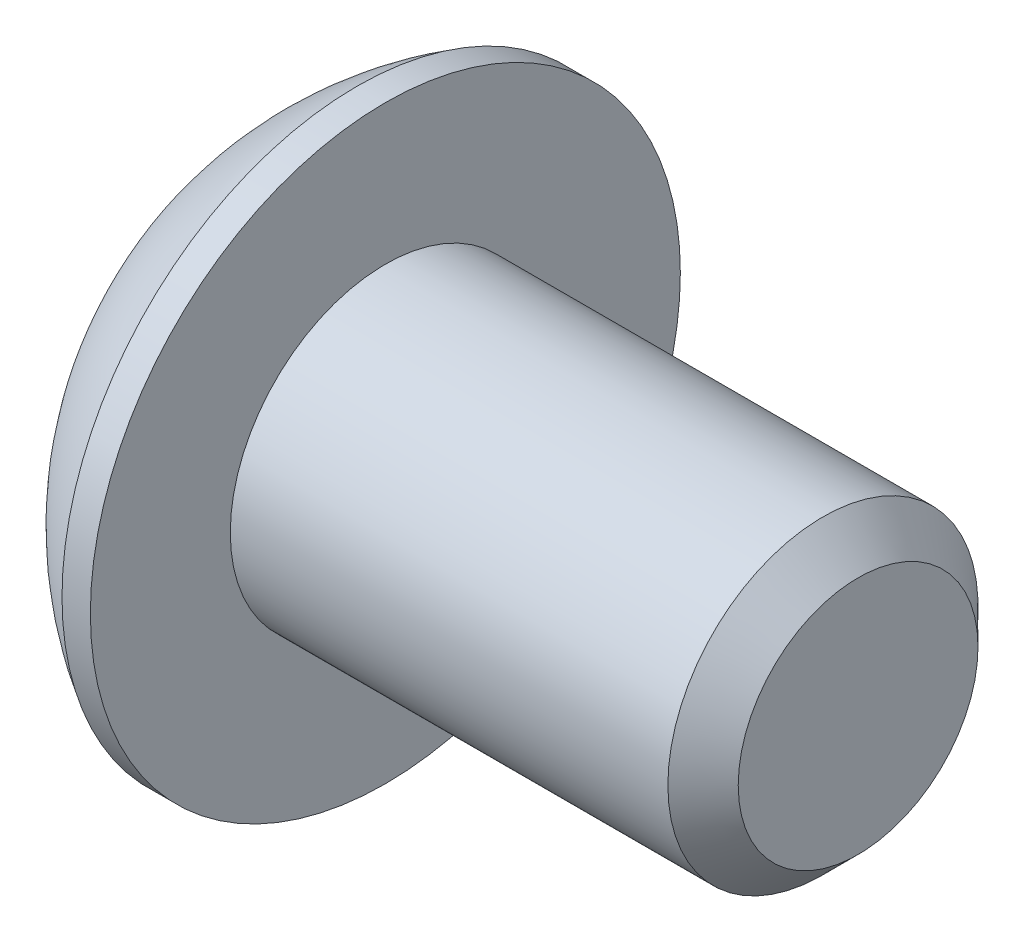
ISO-10303-21;
HEADER;
FILE_DESCRIPTION(('STEP AP214'),'2;1');
FILE_NAME('part.step','',(''),(''),'','','');
FILE_SCHEMA(('AUTOMOTIVE_DESIGN { 1 0 10303 214 1 1 1 1 }'));
ENDSEC;
DATA;
#1=APPLICATION_CONTEXT('core data for automotive mechanical design processes');
#2=APPLICATION_PROTOCOL_DEFINITION('international standard','automotive_design',2000,#1);
#3=PRODUCT_CONTEXT('',#1,'mechanical');
#4=PRODUCT('Part','Part','',(#3));
#5=PRODUCT_RELATED_PRODUCT_CATEGORY('part','',(#4));
#6=PRODUCT_DEFINITION_FORMATION('','',#4);
#7=PRODUCT_DEFINITION_CONTEXT('part definition',#1,'design');
#8=PRODUCT_DEFINITION('design','',#6,#7);
#9=PRODUCT_DEFINITION_SHAPE('','',#8);
#10=(LENGTH_UNIT() NAMED_UNIT(*) SI_UNIT(.MILLI.,.METRE.));
#11=(NAMED_UNIT(*) PLANE_ANGLE_UNIT() SI_UNIT($,.RADIAN.));
#12=(NAMED_UNIT(*) SI_UNIT($,.STERADIAN.) SOLID_ANGLE_UNIT());
#13=UNCERTAINTY_MEASURE_WITH_UNIT(LENGTH_MEASURE(1.E-05),#10,'distance_accuracy_value','');
#14=(GEOMETRIC_REPRESENTATION_CONTEXT(3) GLOBAL_UNCERTAINTY_ASSIGNED_CONTEXT((#13)) GLOBAL_UNIT_ASSIGNED_CONTEXT((#10,
#11,#12)) REPRESENTATION_CONTEXT('',''));
#15=CARTESIAN_POINT('',(0.,0.,0.));
#16=DIRECTION('',(0.,0.,1.));
#17=DIRECTION('',(1.,0.,0.));
#18=AXIS2_PLACEMENT_3D('',#15,#16,#17);
#19=CARTESIAN_POINT('',(8.55980000000001,0.,0.));
#20=DIRECTION('',(-1.,0.,0.));
#21=DIRECTION('',(0.,0.,1.));
#22=AXIS2_PLACEMENT_3D('',#19,#20,#21);
#23=PLANE('',#22);
#24=CARTESIAN_POINT('',(8.55979999994361,0.,0.));
#25=DIRECTION('',(-1.,0.,0.));
#26=DIRECTION('',(0.,0.,1.));
#27=AXIS2_PLACEMENT_3D('',#24,#25,#26);
#28=CIRCLE('',#27,1.61036000008604);
#29=CARTESIAN_POINT('',(8.55979999994361,0.,1.61036000008608));
#30=VERTEX_POINT('',#29);
#31=EDGE_CURVE('E20',#30,#30,#28,.T.);
#32=ORIENTED_EDGE('',*,*,#31,.F.);
#33=EDGE_LOOP('',(#32));
#34=FACE_BOUND('',#33,.T.);
#35=ADVANCED_FACE('F16',(#34),#23,.F.);
#36=CARTESIAN_POINT('',(8.08735999999044,0.,0.));
#37=DIRECTION('',(-1.,0.,0.));
#38=DIRECTION('',(0.,0.,1.));
#39=AXIS2_PLACEMENT_3D('',#36,#37,#38);
#40=CONICAL_SURFACE('',#39,2.08280000003921,0.785398163397448);
#41=ORIENTED_EDGE('',*,*,#31,.T.);
#42=EDGE_LOOP('',(#41));
#43=FACE_BOUND('',#42,.T.);
#44=CARTESIAN_POINT('',(8.08735999999999,0.,0.));
#45=DIRECTION('',(-1.,0.,0.));
#46=DIRECTION('',(0.,0.,1.));
#47=AXIS2_PLACEMENT_3D('',#44,#45,#46);
#48=CIRCLE('',#47,2.08280000000002);
#49=CARTESIAN_POINT('',(8.08735999999999,0.,2.08280000000002));
#50=VERTEX_POINT('',#49);
#51=EDGE_CURVE('E108',#50,#50,#48,.T.);
#52=ORIENTED_EDGE('',*,*,#51,.F.);
#53=EDGE_LOOP('',(#52));
#54=FACE_BOUND('',#53,.T.);
#55=ADVANCED_FACE('F310',(#43,#54),#40,.T.);
#56=CARTESIAN_POINT('',(1.32079999991674,0.,0.));
#57=DIRECTION('',(-1.,0.,0.));
#58=DIRECTION('',(0.,0.,1.));
#59=AXIS2_PLACEMENT_3D('',#56,#57,#58);
#60=CONICAL_SURFACE('',#59,1.19380000000998,1.04719755121067);
#61=CARTESIAN_POINT('',(2.01004075125866,0.,0.));
#62=VERTEX_POINT('',#61);
#63=VERTEX_LOOP('',#62);
#64=FACE_BOUND('',#63,.T.);
#65=CARTESIAN_POINT('',(1.32079999991674,0.,0.));
#66=DIRECTION('',(-1.,0.,0.));
#67=DIRECTION('',(0.,0.,1.));
#68=AXIS2_PLACEMENT_3D('',#65,#66,#67);
#69=CIRCLE('',#68,1.19380000000998);
#70=CARTESIAN_POINT('',(1.32079999995841,-1.03386112704217,0.596900000002525));
#71=VERTEX_POINT('',#70);
#72=CARTESIAN_POINT('',(1.32079999995191,0.,1.19379999997911));
#73=VERTEX_POINT('',#72);
#74=EDGE_CURVE('E93',#71,#73,#69,.T.);
#75=ORIENTED_EDGE('',*,*,#74,.T.);
#76=CARTESIAN_POINT('',(1.32079999991674,0.,0.));
#77=DIRECTION('',(-1.,0.,0.));
#78=DIRECTION('',(0.,0.,1.));
#79=AXIS2_PLACEMENT_3D('',#76,#77,#78);
#80=CIRCLE('',#79,1.19380000000998);
#81=CARTESIAN_POINT('',(1.32079999995841,1.03386112704219,0.596900000002536));
#82=VERTEX_POINT('',#81);
#83=EDGE_CURVE('E87',#73,#82,#80,.T.);
#84=ORIENTED_EDGE('',*,*,#83,.T.);
#85=CARTESIAN_POINT('',(1.32079999991674,0.,0.));
#86=DIRECTION('',(-1.,0.,0.));
#87=DIRECTION('',(0.,0.,1.));
#88=AXIS2_PLACEMENT_3D('',#85,#86,#87);
#89=CIRCLE('',#88,1.19380000000998);
#90=CARTESIAN_POINT('',(1.3207999999586,1.03386112704219,-0.596900000002484));
#91=VERTEX_POINT('',#90);
#92=EDGE_CURVE('E90',#82,#91,#89,.T.);
#93=ORIENTED_EDGE('',*,*,#92,.T.);
#94=CARTESIAN_POINT('',(1.32079999991674,0.,0.));
#95=DIRECTION('',(-1.,0.,0.));
#96=DIRECTION('',(0.,0.,1.));
#97=AXIS2_PLACEMENT_3D('',#94,#95,#96);
#98=CIRCLE('',#97,1.19380000000998);
#99=CARTESIAN_POINT('',(1.32079999995838,1.49000099134676E-12,-1.19380000000498));
#100=VERTEX_POINT('',#99);
#101=EDGE_CURVE('E152',#91,#100,#98,.T.);
#102=ORIENTED_EDGE('',*,*,#101,.T.);
#103=CARTESIAN_POINT('',(1.32079999991674,0.,0.));
#104=DIRECTION('',(-1.,0.,0.));
#105=DIRECTION('',(0.,0.,1.));
#106=AXIS2_PLACEMENT_3D('',#103,#104,#105);
#107=CIRCLE('',#106,1.19380000000998);
#108=CARTESIAN_POINT('',(1.3207999999586,-1.03386112704217,-0.596900000002466));
#109=VERTEX_POINT('',#108);
#110=EDGE_CURVE('E154',#100,#109,#107,.T.);
#111=ORIENTED_EDGE('',*,*,#110,.T.);
#112=CARTESIAN_POINT('',(1.32079999991674,0.,0.));
#113=DIRECTION('',(-1.,0.,0.));
#114=DIRECTION('',(0.,0.,1.));
#115=AXIS2_PLACEMENT_3D('',#112,#113,#114);
#116=CIRCLE('',#115,1.19380000000998);
#117=EDGE_CURVE('E156',#109,#71,#116,.T.);
#118=ORIENTED_EDGE('',*,*,#117,.T.);
#119=EDGE_LOOP('',(#75,#84,#93,#102,#111,#118));
#120=FACE_BOUND('',#119,.T.);
#121=ADVANCED_FACE('F89',(#64,#120),#60,.F.);
#122=CARTESIAN_POINT('',(0.,0.,0.));
#123=DIRECTION('',(-1.,0.,0.));
#124=DIRECTION('',(0.,0.,1.));
#125=AXIS2_PLACEMENT_3D('',#122,#123,#124);
#126=CYLINDRICAL_SURFACE('',#125,2.08280000000002);
#127=ORIENTED_EDGE('',*,*,#51,.T.);
#128=EDGE_LOOP('',(#127));
#129=FACE_BOUND('',#128,.T.);
#130=CARTESIAN_POINT('',(2.20979999999998,0.,0.));
#131=DIRECTION('',(-1.,0.,0.));
#132=DIRECTION('',(0.,0.,1.));
#133=AXIS2_PLACEMENT_3D('',#130,#131,#132);
#134=CIRCLE('',#133,2.08280000000002);
#135=CARTESIAN_POINT('',(2.20979999999998,0.,2.08280000000002));
#136=VERTEX_POINT('',#135);
#137=EDGE_CURVE('E149',#136,#136,#134,.F.);
#138=ORIENTED_EDGE('',*,*,#137,.T.);
#139=EDGE_LOOP('',(#138));
#140=FACE_BOUND('',#139,.T.);
#141=ADVANCED_FACE('F301',(#129,#140),#126,.T.);
#142=CARTESIAN_POINT('',(1.32080000000001,-2.06772225407572,-1.19379999999998));
#143=DIRECTION('',(1.,0.,0.));
#144=DIRECTION('',(0.,0.,-1.));
#145=AXIS2_PLACEMENT_3D('',#142,#143,#144);
#146=PLANE('',#145);
#147=DIRECTION('',(0.,-0.5,-0.866025403784439));
#148=VECTOR('',#147,1.);
#149=CARTESIAN_POINT('',(1.32080000000045,1.37848150271718,0.));
#150=LINE('',#149,#148);
#151=CARTESIAN_POINT('',(1.32080000000016,1.37848150271718,0.));
#152=VERTEX_POINT('',#151);
#153=EDGE_CURVE('E106',#91,#152,#150,.F.);
#154=ORIENTED_EDGE('',*,*,#153,.F.);
#155=ORIENTED_EDGE('',*,*,#92,.F.);
#156=DIRECTION('',(0.,0.5,-0.866025403784438));
#157=VECTOR('',#156,1.);
#158=CARTESIAN_POINT('',(1.32080000000001,0.68924075135858,1.19380000000002));
#159=LINE('',#158,#157);
#160=EDGE_CURVE('E104',#152,#82,#159,.F.);
#161=ORIENTED_EDGE('',*,*,#160,.F.);
#162=EDGE_LOOP('',(#154,#155,#161));
#163=FACE_BOUND('',#162,.T.);
#164=ADVANCED_FACE('F102',(#163),#146,.F.);
#165=CARTESIAN_POINT('',(1.32080000000001,-2.06772225407572,-1.19379999999998));
#166=DIRECTION('',(1.,0.,0.));
#167=DIRECTION('',(0.,0.,-1.));
#168=AXIS2_PLACEMENT_3D('',#165,#166,#167);
#169=PLANE('',#168);
#170=DIRECTION('',(0.,0.5,-0.866025403784438));
#171=VECTOR('',#170,1.);
#172=CARTESIAN_POINT('',(1.32080000000007,0.68924075135858,1.19380000000002));
#173=LINE('',#172,#171);
#174=CARTESIAN_POINT('',(1.32080000000028,0.6892407513586,1.19380000000003));
#175=VERTEX_POINT('',#174);
#176=EDGE_CURVE('E109',#82,#175,#173,.F.);
#177=ORIENTED_EDGE('',*,*,#176,.F.);
#178=ORIENTED_EDGE('',*,*,#83,.F.);
#179=DIRECTION('',(0.,1.,0.));
#180=VECTOR('',#179,1.);
#181=CARTESIAN_POINT('',(1.32080000000051,-0.689240751358577,1.19380000000003));
#182=LINE('',#181,#180);
#183=EDGE_CURVE('E112',#175,#73,#182,.F.);
#184=ORIENTED_EDGE('',*,*,#183,.F.);
#185=EDGE_LOOP('',(#177,#178,#184));
#186=FACE_BOUND('',#185,.T.);
#187=ADVANCED_FACE('F110',(#186),#169,.F.);
#188=CARTESIAN_POINT('',(1.32080000000001,-2.06772225407572,-1.19379999999998));
#189=DIRECTION('',(1.,0.,0.));
#190=DIRECTION('',(0.,0.,-1.));
#191=AXIS2_PLACEMENT_3D('',#188,#189,#190);
#192=PLANE('',#191);
#193=DIRECTION('',(0.,1.,0.));
#194=VECTOR('',#193,1.);
#195=CARTESIAN_POINT('',(1.32080000000057,-0.689240751358577,1.19380000000003));
#196=LINE('',#195,#194);
#197=CARTESIAN_POINT('',(1.32080000000045,-0.689240751358574,1.19380000000003));
#198=VERTEX_POINT('',#197);
#199=EDGE_CURVE('E170',#73,#198,#196,.F.);
#200=ORIENTED_EDGE('',*,*,#199,.F.);
#201=ORIENTED_EDGE('',*,*,#74,.F.);
#202=DIRECTION('',(0.,0.5,0.866025403784439));
#203=VECTOR('',#202,1.);
#204=CARTESIAN_POINT('',(1.32080000000051,-1.37848150271714,0.));
#205=LINE('',#204,#203);
#206=EDGE_CURVE('E168',#198,#71,#205,.F.);
#207=ORIENTED_EDGE('',*,*,#206,.F.);
#208=EDGE_LOOP('',(#200,#201,#207));
#209=FACE_BOUND('',#208,.T.);
#210=ADVANCED_FACE('F166',(#209),#192,.F.);
#211=CARTESIAN_POINT('',(1.32080000000001,-2.06772225407572,-1.19379999999998));
#212=DIRECTION('',(1.,0.,0.));
#213=DIRECTION('',(0.,0.,-1.));
#214=AXIS2_PLACEMENT_3D('',#211,#212,#213);
#215=PLANE('',#214);
#216=DIRECTION('',(0.,0.5,0.866025403784439));
#217=VECTOR('',#216,1.);
#218=CARTESIAN_POINT('',(1.32080000000007,-1.37848150271714,0.));
#219=LINE('',#218,#217);
#220=CARTESIAN_POINT('',(1.32080000000003,-1.37848150271713,0.));
#221=VERTEX_POINT('',#220);
#222=EDGE_CURVE('E171',#71,#221,#219,.F.);
#223=ORIENTED_EDGE('',*,*,#222,.F.);
#224=ORIENTED_EDGE('',*,*,#117,.F.);
#225=DIRECTION('',(0.,-0.5,0.866025403784439));
#226=VECTOR('',#225,1.);
#227=CARTESIAN_POINT('',(1.32080000000001,-0.689240751358577,-1.19379999999997));
#228=LINE('',#227,#226);
#229=EDGE_CURVE('E174',#221,#109,#228,.F.);
#230=ORIENTED_EDGE('',*,*,#229,.F.);
#231=EDGE_LOOP('',(#223,#224,#230));
#232=FACE_BOUND('',#231,.T.);
#233=ADVANCED_FACE('F172',(#232),#215,.F.);
#234=CARTESIAN_POINT('',(1.32080000000001,-2.06772225407572,-1.19379999999998));
#235=DIRECTION('',(1.,0.,0.));
#236=DIRECTION('',(0.,0.,-1.));
#237=AXIS2_PLACEMENT_3D('',#234,#235,#236);
#238=PLANE('',#237);
#239=DIRECTION('',(0.,-0.5,0.866025403784439));
#240=VECTOR('',#239,1.);
#241=CARTESIAN_POINT('',(1.32080000000045,-0.689240751358577,-1.19379999999997));
#242=LINE('',#241,#240);
#243=CARTESIAN_POINT('',(1.32080000000016,-0.689240751358563,-1.19379999999999));
#244=VERTEX_POINT('',#243);
#245=EDGE_CURVE('E229',#109,#244,#242,.F.);
#246=ORIENTED_EDGE('',*,*,#245,.F.);
#247=ORIENTED_EDGE('',*,*,#110,.F.);
#248=DIRECTION('',(0.,1.,0.));
#249=VECTOR('',#248,1.);
#250=CARTESIAN_POINT('',(1.32080000000001,0.689240751358615,-1.19380000000001));
#251=LINE('',#250,#249);
#252=EDGE_CURVE('E241',#244,#100,#251,.T.);
#253=ORIENTED_EDGE('',*,*,#252,.F.);
#254=EDGE_LOOP('',(#246,#247,#253));
#255=FACE_BOUND('',#254,.T.);
#256=ADVANCED_FACE('F262',(#255),#238,.F.);
#257=CARTESIAN_POINT('',(1.32080000000001,-2.06772225407572,-1.19379999999998));
#258=DIRECTION('',(1.,0.,0.));
#259=DIRECTION('',(0.,0.,-1.));
#260=AXIS2_PLACEMENT_3D('',#257,#258,#259);
#261=PLANE('',#260);
#262=DIRECTION('',(0.,1.,0.));
#263=VECTOR('',#262,1.);
#264=CARTESIAN_POINT('',(1.32080000000001,0.689240751358615,-1.19380000000001));
#265=LINE('',#264,#263);
#266=CARTESIAN_POINT('',(1.32080000000001,0.689240751358576,-1.19380000000002));
#267=VERTEX_POINT('',#266);
#268=EDGE_CURVE('E249',#100,#267,#265,.T.);
#269=ORIENTED_EDGE('',*,*,#268,.F.);
#270=ORIENTED_EDGE('',*,*,#101,.F.);
#271=DIRECTION('',(0.,-0.5,-0.866025403784439));
#272=VECTOR('',#271,1.);
#273=CARTESIAN_POINT('',(1.32080000000001,1.37848150271718,0.));
#274=LINE('',#273,#272);
#275=EDGE_CURVE('E131',#267,#91,#274,.F.);
#276=ORIENTED_EDGE('',*,*,#275,.F.);
#277=EDGE_LOOP('',(#269,#270,#276));
#278=FACE_BOUND('',#277,.T.);
#279=ADVANCED_FACE('F264',(#278),#261,.F.);
#280=CARTESIAN_POINT('',(2.20979999999998,2.08280000000001,0.));
#281=DIRECTION('',(-1.,0.,0.));
#282=DIRECTION('',(0.,0.,1.));
#283=AXIS2_PLACEMENT_3D('',#280,#281,#282);
#284=PLANE('',#283);
#285=CARTESIAN_POINT('',(2.20979999999998,0.,0.));
#286=DIRECTION('',(-1.,0.,0.));
#287=DIRECTION('',(0.,0.,1.));
#288=AXIS2_PLACEMENT_3D('',#285,#286,#287);
#289=CIRCLE('',#288,3.96240000000004);
#290=CARTESIAN_POINT('',(2.20979999999998,0.,3.96240000000004));
#291=VERTEX_POINT('',#290);
#292=EDGE_CURVE('E138',#291,#291,#289,.T.);
#293=ORIENTED_EDGE('',*,*,#292,.F.);
#294=EDGE_LOOP('',(#293));
#295=FACE_BOUND('',#294,.T.);
#296=ORIENTED_EDGE('',*,*,#137,.F.);
#297=EDGE_LOOP('',(#296));
#298=FACE_BOUND('',#297,.T.);
#299=ADVANCED_FACE('F295',(#295,#298),#284,.F.);
#300=CARTESIAN_POINT('',(1.32080000000001,1.37848150271718,0.));
#301=DIRECTION('',(0.,-0.866025403784439,0.5));
#302=DIRECTION('',(0.,-0.5,-0.866025403784439));
#303=AXIS2_PLACEMENT_3D('',#300,#301,#302);
#304=PLANE('',#303);
#305=ORIENTED_EDGE('',*,*,#153,.T.);
#306=DIRECTION('',(1.,0.,0.));
#307=VECTOR('',#306,1.);
#308=CARTESIAN_POINT('',(1.32080000000051,1.37848150271717,0.));
#309=LINE('',#308,#307);
#310=CARTESIAN_POINT('',(0.,1.37848150271718,0.));
#311=VERTEX_POINT('',#310);
#312=EDGE_CURVE('E119',#311,#152,#309,.T.);
#313=ORIENTED_EDGE('',*,*,#312,.F.);
#314=DIRECTION('',(0.,0.499999999999998,0.86602540378444));
#315=VECTOR('',#314,1.);
#316=CARTESIAN_POINT('',(0.,0.689240751358606,-1.19380000000002));
#317=LINE('',#316,#315);
#318=CARTESIAN_POINT('',(0.,0.689240751358589,-1.19380000000001));
#319=VERTEX_POINT('',#318);
#320=EDGE_CURVE('E134',#319,#311,#317,.T.);
#321=ORIENTED_EDGE('',*,*,#320,.F.);
#322=DIRECTION('',(1.,0.,0.));
#323=VECTOR('',#322,1.);
#324=CARTESIAN_POINT('',(1.32080000000001,0.689240751358594,-1.19380000000001));
#325=LINE('',#324,#323);
#326=EDGE_CURVE('E148',#267,#319,#325,.F.);
#327=ORIENTED_EDGE('',*,*,#326,.F.);
#328=ORIENTED_EDGE('',*,*,#275,.T.);
#329=EDGE_LOOP('',(#305,#313,#321,#327,#328));
#330=FACE_BOUND('',#329,.T.);
#331=ADVANCED_FACE('F267',(#330),#304,.T.);
#332=CARTESIAN_POINT('',(1.32080000000051,0.68924075135858,1.19380000000002));
#333=DIRECTION('',(0.,-0.866025403784438,-0.5));
#334=DIRECTION('',(0.,0.5,-0.866025403784438));
#335=AXIS2_PLACEMENT_3D('',#332,#333,#334);
#336=PLANE('',#335);
#337=ORIENTED_EDGE('',*,*,#176,.T.);
#338=DIRECTION('',(1.,0.,0.));
#339=VECTOR('',#338,1.);
#340=CARTESIAN_POINT('',(1.32080000000051,0.68924075135861,1.19380000000003));
#341=LINE('',#340,#339);
#342=CARTESIAN_POINT('',(1.87350135405495E-13,0.689240751358602,1.19380000000002));
#343=VERTEX_POINT('',#342);
#344=EDGE_CURVE('E115',#343,#175,#341,.T.);
#345=ORIENTED_EDGE('',*,*,#344,.F.);
#346=DIRECTION('',(0.,-0.5,0.866025403784439));
#347=VECTOR('',#346,1.);
#348=CARTESIAN_POINT('',(0.,1.37848150271719,0.));
#349=LINE('',#348,#347);
#350=EDGE_CURVE('E137',#311,#343,#349,.T.);
#351=ORIENTED_EDGE('',*,*,#350,.F.);
#352=ORIENTED_EDGE('',*,*,#312,.T.);
#353=ORIENTED_EDGE('',*,*,#160,.T.);
#354=EDGE_LOOP('',(#337,#345,#351,#352,#353));
#355=FACE_BOUND('',#354,.T.);
#356=ADVANCED_FACE('F117',(#355),#336,.T.);
#357=CARTESIAN_POINT('',(1.32080000000051,-0.689240751358577,1.19380000000003));
#358=DIRECTION('',(0.,0.,-1.));
#359=DIRECTION('',(0.,1.,0.));
#360=AXIS2_PLACEMENT_3D('',#357,#358,#359);
#361=PLANE('',#360);
#362=ORIENTED_EDGE('',*,*,#199,.T.);
#363=DIRECTION('',(1.,0.,0.));
#364=VECTOR('',#363,1.);
#365=CARTESIAN_POINT('',(1.32080000000001,-0.689240751358573,1.19380000000003));
#366=LINE('',#365,#364);
#367=CARTESIAN_POINT('',(1.2490009027033E-13,-0.689240751358571,1.19380000000003));
#368=VERTEX_POINT('',#367);
#369=EDGE_CURVE('E181',#368,#198,#366,.T.);
#370=ORIENTED_EDGE('',*,*,#369,.F.);
#371=DIRECTION('',(0.,1.,0.));
#372=VECTOR('',#371,1.);
#373=CARTESIAN_POINT('',(0.,0.,1.19380000000001));
#374=LINE('',#373,#372);
#375=EDGE_CURVE('E195',#343,#368,#374,.F.);
#376=ORIENTED_EDGE('',*,*,#375,.F.);
#377=ORIENTED_EDGE('',*,*,#344,.T.);
#378=ORIENTED_EDGE('',*,*,#183,.T.);
#379=EDGE_LOOP('',(#362,#370,#376,#377,#378));
#380=FACE_BOUND('',#379,.T.);
#381=ADVANCED_FACE('F217',(#380),#361,.T.);
#382=CARTESIAN_POINT('',(1.32080000000001,-1.37848150271714,0.));
#383=DIRECTION('',(0.,0.866025403784439,-0.5));
#384=DIRECTION('',(0.,0.5,0.866025403784439));
#385=AXIS2_PLACEMENT_3D('',#382,#383,#384);
#386=PLANE('',#385);
#387=ORIENTED_EDGE('',*,*,#222,.T.);
#388=DIRECTION('',(1.,0.,0.));
#389=VECTOR('',#388,1.);
#390=CARTESIAN_POINT('',(1.32080000000001,-1.37848150271713,0.));
#391=LINE('',#390,#389);
#392=CARTESIAN_POINT('',(0.,-1.37848150271714,0.));
#393=VERTEX_POINT('',#392);
#394=EDGE_CURVE('E177',#393,#221,#391,.T.);
#395=ORIENTED_EDGE('',*,*,#394,.F.);
#396=DIRECTION('',(0.,-0.499999999999989,-0.866025403784445));
#397=VECTOR('',#396,1.);
#398=CARTESIAN_POINT('',(0.,-0.689240751358566,1.19380000000003));
#399=LINE('',#398,#397);
#400=EDGE_CURVE('E198',#368,#393,#399,.T.);
#401=ORIENTED_EDGE('',*,*,#400,.F.);
#402=ORIENTED_EDGE('',*,*,#369,.T.);
#403=ORIENTED_EDGE('',*,*,#206,.T.);
#404=EDGE_LOOP('',(#387,#395,#401,#402,#403));
#405=FACE_BOUND('',#404,.T.);
#406=ADVANCED_FACE('F179',(#405),#386,.T.);
#407=CARTESIAN_POINT('',(1.32080000000001,-0.689240751358577,-1.19379999999997));
#408=DIRECTION('',(0.,0.866025403784439,0.5));
#409=DIRECTION('',(0.,-0.5,0.866025403784439));
#410=AXIS2_PLACEMENT_3D('',#407,#408,#409);
#411=PLANE('',#410);
#412=ORIENTED_EDGE('',*,*,#245,.T.);
#413=DIRECTION('',(1.,0.,0.));
#414=VECTOR('',#413,1.);
#415=CARTESIAN_POINT('',(1.32080000000001,-0.689240751358556,-1.19380000000001));
#416=LINE('',#415,#414);
#417=CARTESIAN_POINT('',(0.,-0.689240751358556,-1.19380000000001));
#418=VERTEX_POINT('',#417);
#419=EDGE_CURVE('E35',#418,#244,#416,.T.);
#420=ORIENTED_EDGE('',*,*,#419,.F.);
#421=DIRECTION('',(0.,0.50000000000001,-0.866025403784433));
#422=VECTOR('',#421,1.);
#423=CARTESIAN_POINT('',(0.,-1.37848150271715,0.));
#424=LINE('',#423,#422);
#425=EDGE_CURVE('E218',#393,#418,#424,.T.);
#426=ORIENTED_EDGE('',*,*,#425,.F.);
#427=ORIENTED_EDGE('',*,*,#394,.T.);
#428=ORIENTED_EDGE('',*,*,#229,.T.);
#429=EDGE_LOOP('',(#412,#420,#426,#427,#428));
#430=FACE_BOUND('',#429,.T.);
#431=ADVANCED_FACE('F268',(#430),#411,.T.);
#432=CARTESIAN_POINT('',(1.32080000000001,0.689240751358615,-1.19380000000001));
#433=DIRECTION('',(0.,0.,1.));
#434=DIRECTION('',(1.,0.,0.));
#435=AXIS2_PLACEMENT_3D('',#432,#433,#434);
#436=PLANE('',#435);
#437=ORIENTED_EDGE('',*,*,#268,.T.);
#438=ORIENTED_EDGE('',*,*,#326,.T.);
#439=DIRECTION('',(0.,1.,0.));
#440=VECTOR('',#439,1.);
#441=CARTESIAN_POINT('',(0.,0.,-1.19380000000001));
#442=LINE('',#441,#440);
#443=EDGE_CURVE('E145',#418,#319,#442,.T.);
#444=ORIENTED_EDGE('',*,*,#443,.F.);
#445=ORIENTED_EDGE('',*,*,#419,.T.);
#446=ORIENTED_EDGE('',*,*,#252,.T.);
#447=EDGE_LOOP('',(#437,#438,#444,#445,#446));
#448=FACE_BOUND('',#447,.T.);
#449=ADVANCED_FACE('F259',(#448),#436,.T.);
#450=CARTESIAN_POINT('',(0.,0.,0.));
#451=DIRECTION('',(-1.,0.,0.));
#452=DIRECTION('',(0.,0.,1.));
#453=AXIS2_PLACEMENT_3D('',#450,#451,#452);
#454=CYLINDRICAL_SURFACE('',#453,3.96240000000004);
#455=CARTESIAN_POINT('',(1.82880000000002,0.,0.));
#456=DIRECTION('',(-1.,0.,0.));
#457=DIRECTION('',(0.,0.,1.));
#458=AXIS2_PLACEMENT_3D('',#455,#456,#457);
#459=CIRCLE('',#458,3.96240000000004);
#460=CARTESIAN_POINT('',(1.82880000000002,0.,3.96240000000004));
#461=VERTEX_POINT('',#460);
#462=EDGE_CURVE('E26',#461,#461,#459,.T.);
#463=ORIENTED_EDGE('',*,*,#462,.F.);
#464=EDGE_LOOP('',(#463));
#465=FACE_BOUND('',#464,.T.);
#466=ORIENTED_EDGE('',*,*,#292,.T.);
#467=EDGE_LOOP('',(#466));
#468=FACE_BOUND('',#467,.T.);
#469=ADVANCED_FACE('F276',(#465,#468),#454,.T.);
#470=CARTESIAN_POINT('',(0.,0.,0.));
#471=DIRECTION('',(-1.,0.,0.));
#472=DIRECTION('',(0.,0.,1.));
#473=AXIS2_PLACEMENT_3D('',#470,#471,#472);
#474=PLANE('',#473);
#475=CARTESIAN_POINT('',(0.,0.,0.));
#476=DIRECTION('',(-1.,0.,0.));
#477=DIRECTION('',(0.,0.,1.));
#478=AXIS2_PLACEMENT_3D('',#475,#476,#477);
#479=CIRCLE('',#478,1.98120000000045);
#480=CARTESIAN_POINT('',(0.,0.,1.98120000000042));
#481=VERTEX_POINT('',#480);
#482=EDGE_CURVE('E11',#481,#481,#479,.F.);
#483=ORIENTED_EDGE('',*,*,#482,.F.);
#484=EDGE_LOOP('',(#483));
#485=FACE_BOUND('',#484,.T.);
#486=ORIENTED_EDGE('',*,*,#425,.T.);
#487=ORIENTED_EDGE('',*,*,#443,.T.);
#488=ORIENTED_EDGE('',*,*,#320,.T.);
#489=ORIENTED_EDGE('',*,*,#350,.T.);
#490=ORIENTED_EDGE('',*,*,#375,.T.);
#491=ORIENTED_EDGE('',*,*,#400,.T.);
#492=EDGE_LOOP('',(#486,#487,#488,#489,#490,#491));
#493=FACE_BOUND('',#492,.T.);
#494=ADVANCED_FACE('F211',(#485,#493),#474,.T.);
#495=CARTESIAN_POINT('',(4.13384999999996,0.,0.));
#496=DIRECTION('',(0.,1.,0.));
#497=DIRECTION('',(-0.489667403954923,0.,-0.8719093034852));
#498=AXIS2_PLACEMENT_3D('',#495,#496,#497);
#499=SPHERICAL_SURFACE('',#498,4.58408870578455);
#500=CARTESIAN_POINT('',(4.13384999999996,0.,0.));
#501=DIRECTION('',(-1.,0.,0.));
#502=DIRECTION('',(0.,0.,1.));
#503=AXIS2_PLACEMENT_3D('',#500,#501,#502);
#504=SPHERICAL_SURFACE('',#503,4.58408870578455);
#505=ORIENTED_EDGE('',*,*,#482,.T.);
#506=EDGE_LOOP('',(#505));
#507=FACE_BOUND('',#506,.T.);
#508=ORIENTED_EDGE('',*,*,#462,.T.);
#509=EDGE_LOOP('',(#508));
#510=FACE_BOUND('',#509,.T.);
#511=ADVANCED_FACE('F18',(#507,#510),#504,.T.);
#512=CLOSED_SHELL('',(#35,#55,#121,#141,#164,#187,#210,#233,#256,#279,#299,#331,#356,#381,#406,
#431,#449,#469,#494,#511));
#513=MANIFOLD_SOLID_BREP('B1',#512);
#514=ADVANCED_BREP_SHAPE_REPRESENTATION('',(#18,#513),#14);
#515=SHAPE_DEFINITION_REPRESENTATION(#9,#514);
ENDSEC;
END-ISO-10303-21;
